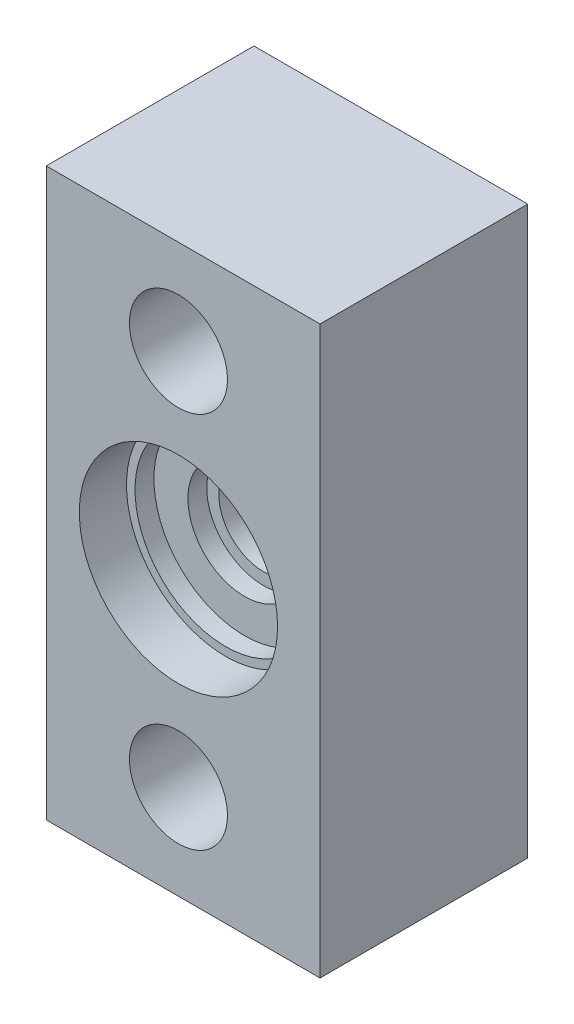
ISO-10303-21;
HEADER;
FILE_DESCRIPTION(('STEP AP214'),'2;1');
FILE_NAME('part.step','',(''),(''),'','','');
FILE_SCHEMA(('AUTOMOTIVE_DESIGN { 1 0 10303 214 1 1 1 1 }'));
ENDSEC;
DATA;
#1=APPLICATION_CONTEXT('core data for automotive mechanical design processes');
#2=APPLICATION_PROTOCOL_DEFINITION('international standard','automotive_design',2000,#1);
#3=PRODUCT_CONTEXT('',#1,'mechanical');
#4=PRODUCT('Part','Part','',(#3));
#5=PRODUCT_RELATED_PRODUCT_CATEGORY('part','',(#4));
#6=PRODUCT_DEFINITION_FORMATION('','',#4);
#7=PRODUCT_DEFINITION_CONTEXT('part definition',#1,'design');
#8=PRODUCT_DEFINITION('design','',#6,#7);
#9=PRODUCT_DEFINITION_SHAPE('','',#8);
#10=(LENGTH_UNIT() NAMED_UNIT(*) SI_UNIT(.MILLI.,.METRE.));
#11=(NAMED_UNIT(*) PLANE_ANGLE_UNIT() SI_UNIT($,.RADIAN.));
#12=(NAMED_UNIT(*) SI_UNIT($,.STERADIAN.) SOLID_ANGLE_UNIT());
#13=UNCERTAINTY_MEASURE_WITH_UNIT(LENGTH_MEASURE(1.E-05),#10,'distance_accuracy_value','');
#14=(GEOMETRIC_REPRESENTATION_CONTEXT(3) GLOBAL_UNCERTAINTY_ASSIGNED_CONTEXT((#13)) GLOBAL_UNIT_ASSIGNED_CONTEXT((#10,
#11,#12)) REPRESENTATION_CONTEXT('',''));
#15=CARTESIAN_POINT('',(0.,0.,0.));
#16=DIRECTION('',(0.,0.,1.));
#17=DIRECTION('',(1.,0.,0.));
#18=AXIS2_PLACEMENT_3D('',#15,#16,#17);
#19=CARTESIAN_POINT('',(0.,0.,6.));
#20=DIRECTION('',(0.,0.,-1.));
#21=DIRECTION('',(-1.,0.,0.));
#22=AXIS2_PLACEMENT_3D('',#19,#20,#21);
#23=CYLINDRICAL_SURFACE('',#22,2.36);
#24=CARTESIAN_POINT('',(0.,0.,0.));
#25=DIRECTION('',(0.,0.,-1.));
#26=DIRECTION('',(-1.,0.,0.));
#27=AXIS2_PLACEMENT_3D('',#24,#25,#26);
#28=CIRCLE('',#27,2.36);
#29=CARTESIAN_POINT('',(-2.36,0.,0.));
#30=VERTEX_POINT('',#29);
#31=EDGE_CURVE('E104',#30,#30,#28,.F.);
#32=ORIENTED_EDGE('',*,*,#31,.F.);
#33=EDGE_LOOP('',(#32));
#34=FACE_BOUND('',#33,.T.);
#35=CARTESIAN_POINT('',(0.,0.,1.5));
#36=DIRECTION('',(0.,0.,1.));
#37=DIRECTION('',(1.,0.,0.));
#38=AXIS2_PLACEMENT_3D('',#35,#36,#37);
#39=CIRCLE('',#38,2.36);
#40=CARTESIAN_POINT('',(2.36,0.,1.5));
#41=VERTEX_POINT('',#40);
#42=EDGE_CURVE('E48',#41,#41,#39,.T.);
#43=ORIENTED_EDGE('',*,*,#42,.T.);
#44=EDGE_LOOP('',(#43));
#45=FACE_BOUND('',#44,.T.);
#46=ADVANCED_FACE('F44',(#34,#45),#23,.F.);
#47=CARTESIAN_POINT('',(7.5,-15.,6.));
#48=DIRECTION('',(0.,1.,0.));
#49=DIRECTION('',(-1.,0.,0.));
#50=AXIS2_PLACEMENT_3D('',#47,#48,#49);
#51=PLANE('',#50);
#52=DIRECTION('',(1.,0.,0.));
#53=VECTOR('',#52,1.);
#54=CARTESIAN_POINT('',(7.5,-15.,6.));
#55=LINE('',#54,#53);
#56=CARTESIAN_POINT('',(-7.,-15.,6.));
#57=VERTEX_POINT('',#56);
#58=CARTESIAN_POINT('',(7.5,-15.,6.));
#59=VERTEX_POINT('',#58);
#60=EDGE_CURVE('E127',#57,#59,#55,.T.);
#61=ORIENTED_EDGE('',*,*,#60,.F.);
#62=DIRECTION('',(0.,0.,-1.));
#63=VECTOR('',#62,1.);
#64=CARTESIAN_POINT('',(-7.,-15.,42.5918125935021));
#65=LINE('',#64,#63);
#66=CARTESIAN_POINT('',(-7.,-15.,-5.));
#67=VERTEX_POINT('',#66);
#68=EDGE_CURVE('E89',#57,#67,#65,.T.);
#69=ORIENTED_EDGE('',*,*,#68,.T.);
#70=DIRECTION('',(-1.,0.,0.));
#71=VECTOR('',#70,1.);
#72=CARTESIAN_POINT('',(-7.,-15.,-5.));
#73=LINE('',#72,#71);
#74=CARTESIAN_POINT('',(7.5,-15.,-5.));
#75=VERTEX_POINT('',#74);
#76=EDGE_CURVE('E90',#75,#67,#73,.T.);
#77=ORIENTED_EDGE('',*,*,#76,.F.);
#78=DIRECTION('',(0.,0.,-1.));
#79=VECTOR('',#78,1.);
#80=CARTESIAN_POINT('',(7.5,-15.,6.));
#81=LINE('',#80,#79);
#82=EDGE_CURVE('E11',#59,#75,#81,.T.);
#83=ORIENTED_EDGE('',*,*,#82,.F.);
#84=EDGE_LOOP('',(#61,#69,#77,#83));
#85=FACE_BOUND('',#84,.T.);
#86=ADVANCED_FACE('F46',(#85),#51,.F.);
#87=CARTESIAN_POINT('',(7.5,15.,6.));
#88=DIRECTION('',(-1.,0.,0.));
#89=DIRECTION('',(0.,-1.,0.));
#90=AXIS2_PLACEMENT_3D('',#87,#88,#89);
#91=PLANE('',#90);
#92=ORIENTED_EDGE('',*,*,#82,.T.);
#93=DIRECTION('',(0.,-1.,0.));
#94=VECTOR('',#93,1.);
#95=CARTESIAN_POINT('',(7.50000000000001,15.,-5.));
#96=LINE('',#95,#94);
#97=CARTESIAN_POINT('',(7.50000000000001,15.,-5.));
#98=VERTEX_POINT('',#97);
#99=EDGE_CURVE('E99',#98,#75,#96,.T.);
#100=ORIENTED_EDGE('',*,*,#99,.F.);
#101=DIRECTION('',(0.,0.,-1.));
#102=VECTOR('',#101,1.);
#103=CARTESIAN_POINT('',(7.5,15.,6.));
#104=LINE('',#103,#102);
#105=CARTESIAN_POINT('',(7.5,15.,6.));
#106=VERTEX_POINT('',#105);
#107=EDGE_CURVE('E53',#106,#98,#104,.T.);
#108=ORIENTED_EDGE('',*,*,#107,.F.);
#109=DIRECTION('',(0.,1.,0.));
#110=VECTOR('',#109,1.);
#111=CARTESIAN_POINT('',(7.5,15.,6.));
#112=LINE('',#111,#110);
#113=EDGE_CURVE('E131',#59,#106,#112,.T.);
#114=ORIENTED_EDGE('',*,*,#113,.F.);
#115=EDGE_LOOP('',(#92,#100,#108,#114));
#116=FACE_BOUND('',#115,.T.);
#117=ADVANCED_FACE('F139',(#116),#91,.F.);
#118=CARTESIAN_POINT('',(7.5,15.,6.));
#119=DIRECTION('',(0.,-1.,0.));
#120=DIRECTION('',(1.,0.,0.));
#121=AXIS2_PLACEMENT_3D('',#118,#119,#120);
#122=PLANE('',#121);
#123=ORIENTED_EDGE('',*,*,#107,.T.);
#124=DIRECTION('',(1.,0.,0.));
#125=VECTOR('',#124,1.);
#126=CARTESIAN_POINT('',(-7.,15.,-5.));
#127=LINE('',#126,#125);
#128=CARTESIAN_POINT('',(-7.,15.,-5.));
#129=VERTEX_POINT('',#128);
#130=EDGE_CURVE('E93',#129,#98,#127,.T.);
#131=ORIENTED_EDGE('',*,*,#130,.F.);
#132=DIRECTION('',(0.,0.,-1.));
#133=VECTOR('',#132,1.);
#134=CARTESIAN_POINT('',(-7.00000000000001,15.,42.5918125935021));
#135=LINE('',#134,#133);
#136=CARTESIAN_POINT('',(-7.,15.,6.));
#137=VERTEX_POINT('',#136);
#138=EDGE_CURVE('E60',#137,#129,#135,.T.);
#139=ORIENTED_EDGE('',*,*,#138,.F.);
#140=DIRECTION('',(-1.,0.,0.));
#141=VECTOR('',#140,1.);
#142=CARTESIAN_POINT('',(7.5,15.,6.));
#143=LINE('',#142,#141);
#144=EDGE_CURVE('E133',#106,#137,#143,.T.);
#145=ORIENTED_EDGE('',*,*,#144,.F.);
#146=EDGE_LOOP('',(#123,#131,#139,#145));
#147=FACE_BOUND('',#146,.T.);
#148=ADVANCED_FACE('F94',(#147),#122,.F.);
#149=CARTESIAN_POINT('',(0.,0.,6.));
#150=DIRECTION('',(0.,0.,-1.));
#151=DIRECTION('',(-1.,0.,0.));
#152=AXIS2_PLACEMENT_3D('',#149,#150,#151);
#153=PLANE('',#152);
#154=CARTESIAN_POINT('',(0.,-10.,6.));
#155=DIRECTION('',(0.,0.,-1.));
#156=DIRECTION('',(-1.,0.,0.));
#157=AXIS2_PLACEMENT_3D('',#154,#155,#156);
#158=CIRCLE('',#157,2.595);
#159=CARTESIAN_POINT('',(-2.595,-10.,6.));
#160=VERTEX_POINT('',#159);
#161=EDGE_CURVE('E352',#160,#160,#158,.T.);
#162=ORIENTED_EDGE('',*,*,#161,.T.);
#163=EDGE_LOOP('',(#162));
#164=FACE_BOUND('',#163,.T.);
#165=CARTESIAN_POINT('',(0.,9.99999999999999,6.));
#166=DIRECTION('',(0.,0.,-1.));
#167=DIRECTION('',(-1.,0.,0.));
#168=AXIS2_PLACEMENT_3D('',#165,#166,#167);
#169=CIRCLE('',#168,2.595);
#170=CARTESIAN_POINT('',(-2.595,9.99999999999999,6.));
#171=VERTEX_POINT('',#170);
#172=EDGE_CURVE('E338',#171,#171,#169,.T.);
#173=ORIENTED_EDGE('',*,*,#172,.T.);
#174=EDGE_LOOP('',(#173));
#175=FACE_BOUND('',#174,.T.);
#176=CARTESIAN_POINT('',(0.,0.,6.));
#177=DIRECTION('',(0.,0.,1.));
#178=DIRECTION('',(1.,0.,0.));
#179=AXIS2_PLACEMENT_3D('',#176,#177,#178);
#180=CIRCLE('',#179,5.25);
#181=CARTESIAN_POINT('',(5.25,0.,6.));
#182=VERTEX_POINT('',#181);
#183=EDGE_CURVE('E121',#182,#182,#180,.T.);
#184=ORIENTED_EDGE('',*,*,#183,.F.);
#185=EDGE_LOOP('',(#184));
#186=FACE_BOUND('',#185,.T.);
#187=ORIENTED_EDGE('',*,*,#144,.T.);
#188=DIRECTION('',(0.,-1.,0.));
#189=VECTOR('',#188,1.);
#190=CARTESIAN_POINT('',(-7.,0.,6.));
#191=LINE('',#190,#189);
#192=EDGE_CURVE('E67',#137,#57,#191,.T.);
#193=ORIENTED_EDGE('',*,*,#192,.T.);
#194=ORIENTED_EDGE('',*,*,#60,.T.);
#195=ORIENTED_EDGE('',*,*,#113,.T.);
#196=EDGE_LOOP('',(#187,#193,#194,#195));
#197=FACE_BOUND('',#196,.T.);
#198=ADVANCED_FACE('F135',(#164,#175,#186,#197),#153,.F.);
#199=CARTESIAN_POINT('',(0.,0.,3.5));
#200=DIRECTION('',(0.,0.,1.));
#201=DIRECTION('',(1.,0.,0.));
#202=AXIS2_PLACEMENT_3D('',#199,#200,#201);
#203=CYLINDRICAL_SURFACE('',#202,5.25);
#204=CARTESIAN_POINT('',(0.,0.,3.5));
#205=DIRECTION('',(0.,0.,1.));
#206=DIRECTION('',(1.,0.,0.));
#207=AXIS2_PLACEMENT_3D('',#204,#205,#206);
#208=CIRCLE('',#207,5.25);
#209=CARTESIAN_POINT('',(5.25,0.,3.5));
#210=VERTEX_POINT('',#209);
#211=EDGE_CURVE('E124',#210,#210,#208,.T.);
#212=ORIENTED_EDGE('',*,*,#211,.F.);
#213=EDGE_LOOP('',(#212));
#214=FACE_BOUND('',#213,.T.);
#215=ORIENTED_EDGE('',*,*,#183,.T.);
#216=EDGE_LOOP('',(#215));
#217=FACE_BOUND('',#216,.T.);
#218=ADVANCED_FACE('F165',(#214,#217),#203,.F.);
#219=CARTESIAN_POINT('',(0.,0.,3.5));
#220=DIRECTION('',(0.,0.,1.));
#221=DIRECTION('',(1.,0.,0.));
#222=AXIS2_PLACEMENT_3D('',#219,#220,#221);
#223=PLANE('',#222);
#224=CARTESIAN_POINT('',(0.,0.,3.5));
#225=DIRECTION('',(0.,0.,1.));
#226=DIRECTION('',(1.,0.,0.));
#227=AXIS2_PLACEMENT_3D('',#224,#225,#226);
#228=CIRCLE('',#227,4.8);
#229=CARTESIAN_POINT('',(4.8,0.,3.5));
#230=VERTEX_POINT('',#229);
#231=EDGE_CURVE('E116',#230,#230,#228,.T.);
#232=ORIENTED_EDGE('',*,*,#231,.F.);
#233=EDGE_LOOP('',(#232));
#234=FACE_BOUND('',#233,.T.);
#235=ORIENTED_EDGE('',*,*,#211,.T.);
#236=EDGE_LOOP('',(#235));
#237=FACE_BOUND('',#236,.T.);
#238=ADVANCED_FACE('F161',(#234,#237),#223,.T.);
#239=CARTESIAN_POINT('',(0.,0.,2.5));
#240=DIRECTION('',(0.,0.,1.));
#241=DIRECTION('',(1.,0.,0.));
#242=AXIS2_PLACEMENT_3D('',#239,#240,#241);
#243=CYLINDRICAL_SURFACE('',#242,4.8);
#244=CARTESIAN_POINT('',(0.,0.,2.5));
#245=DIRECTION('',(0.,0.,1.));
#246=DIRECTION('',(1.,0.,0.));
#247=AXIS2_PLACEMENT_3D('',#244,#245,#246);
#248=CIRCLE('',#247,4.8);
#249=CARTESIAN_POINT('',(4.8,0.,2.5));
#250=VERTEX_POINT('',#249);
#251=EDGE_CURVE('E118',#250,#250,#248,.T.);
#252=ORIENTED_EDGE('',*,*,#251,.F.);
#253=EDGE_LOOP('',(#252));
#254=FACE_BOUND('',#253,.T.);
#255=ORIENTED_EDGE('',*,*,#231,.T.);
#256=EDGE_LOOP('',(#255));
#257=FACE_BOUND('',#256,.T.);
#258=ADVANCED_FACE('F157',(#254,#257),#243,.F.);
#259=CARTESIAN_POINT('',(0.,0.,2.5));
#260=DIRECTION('',(0.,0.,1.));
#261=DIRECTION('',(1.,0.,0.));
#262=AXIS2_PLACEMENT_3D('',#259,#260,#261);
#263=PLANE('',#262);
#264=CARTESIAN_POINT('',(0.,0.,2.5));
#265=DIRECTION('',(0.,0.,1.));
#266=DIRECTION('',(1.,0.,0.));
#267=AXIS2_PLACEMENT_3D('',#264,#265,#266);
#268=CIRCLE('',#267,3.);
#269=CARTESIAN_POINT('',(3.,0.,2.5));
#270=VERTEX_POINT('',#269);
#271=EDGE_CURVE('E361',#270,#270,#268,.T.);
#272=ORIENTED_EDGE('',*,*,#271,.F.);
#273=EDGE_LOOP('',(#272));
#274=FACE_BOUND('',#273,.T.);
#275=ORIENTED_EDGE('',*,*,#251,.T.);
#276=EDGE_LOOP('',(#275));
#277=FACE_BOUND('',#276,.T.);
#278=ADVANCED_FACE('F154',(#274,#277),#263,.T.);
#279=CARTESIAN_POINT('',(-7.00000000000001,15.,42.5918125935021));
#280=DIRECTION('',(1.,0.,0.));
#281=DIRECTION('',(0.,1.,0.));
#282=AXIS2_PLACEMENT_3D('',#279,#280,#281);
#283=PLANE('',#282);
#284=ORIENTED_EDGE('',*,*,#192,.F.);
#285=ORIENTED_EDGE('',*,*,#138,.T.);
#286=DIRECTION('',(0.,1.,0.));
#287=VECTOR('',#286,1.);
#288=CARTESIAN_POINT('',(-7.,15.,-5.));
#289=LINE('',#288,#287);
#290=EDGE_CURVE('E88',#67,#129,#289,.T.);
#291=ORIENTED_EDGE('',*,*,#290,.F.);
#292=ORIENTED_EDGE('',*,*,#68,.F.);
#293=EDGE_LOOP('',(#284,#285,#291,#292));
#294=FACE_BOUND('',#293,.T.);
#295=ADVANCED_FACE('F85',(#294),#283,.F.);
#296=CARTESIAN_POINT('',(0.,0.,-5.));
#297=DIRECTION('',(0.,0.,1.));
#298=DIRECTION('',(1.,0.,0.));
#299=AXIS2_PLACEMENT_3D('',#296,#297,#298);
#300=PLANE('',#299);
#301=CARTESIAN_POINT('',(0.,-10.,-5.));
#302=DIRECTION('',(0.,0.,-1.));
#303=DIRECTION('',(-1.,0.,0.));
#304=AXIS2_PLACEMENT_3D('',#301,#302,#303);
#305=CIRCLE('',#304,2.595);
#306=CARTESIAN_POINT('',(-2.595,-10.,-5.));
#307=VERTEX_POINT('',#306);
#308=EDGE_CURVE('E344',#307,#307,#305,.T.);
#309=ORIENTED_EDGE('',*,*,#308,.F.);
#310=EDGE_LOOP('',(#309));
#311=FACE_BOUND('',#310,.T.);
#312=CARTESIAN_POINT('',(0.,9.99999999999999,-5.));
#313=DIRECTION('',(0.,0.,-1.));
#314=DIRECTION('',(-1.,0.,0.));
#315=AXIS2_PLACEMENT_3D('',#312,#313,#314);
#316=CIRCLE('',#315,2.595);
#317=CARTESIAN_POINT('',(-2.595,9.99999999999999,-5.));
#318=VERTEX_POINT('',#317);
#319=EDGE_CURVE('E341',#318,#318,#316,.T.);
#320=ORIENTED_EDGE('',*,*,#319,.F.);
#321=EDGE_LOOP('',(#320));
#322=FACE_BOUND('',#321,.T.);
#323=CARTESIAN_POINT('',(0.,0.,-5.));
#324=DIRECTION('',(0.,0.,-1.));
#325=DIRECTION('',(-1.,0.,0.));
#326=AXIS2_PLACEMENT_3D('',#323,#324,#325);
#327=CIRCLE('',#326,4.);
#328=CARTESIAN_POINT('',(-4.,0.,-5.));
#329=VERTEX_POINT('',#328);
#330=EDGE_CURVE('E110',#329,#329,#327,.T.);
#331=ORIENTED_EDGE('',*,*,#330,.F.);
#332=EDGE_LOOP('',(#331));
#333=FACE_BOUND('',#332,.T.);
#334=ORIENTED_EDGE('',*,*,#290,.T.);
#335=ORIENTED_EDGE('',*,*,#130,.T.);
#336=ORIENTED_EDGE('',*,*,#99,.T.);
#337=ORIENTED_EDGE('',*,*,#76,.T.);
#338=EDGE_LOOP('',(#334,#335,#336,#337));
#339=FACE_BOUND('',#338,.T.);
#340=ADVANCED_FACE('F102',(#311,#322,#333,#339),#300,.F.);
#341=CARTESIAN_POINT('',(0.,0.,0.));
#342=DIRECTION('',(0.,0.,-1.));
#343=DIRECTION('',(-1.,0.,0.));
#344=AXIS2_PLACEMENT_3D('',#341,#342,#343);
#345=PLANE('',#344);
#346=CARTESIAN_POINT('',(0.,0.,0.));
#347=DIRECTION('',(0.,0.,-1.));
#348=DIRECTION('',(-1.,0.,0.));
#349=AXIS2_PLACEMENT_3D('',#346,#347,#348);
#350=CIRCLE('',#349,4.);
#351=CARTESIAN_POINT('',(-4.,0.,0.));
#352=VERTEX_POINT('',#351);
#353=EDGE_CURVE('E107',#352,#352,#350,.T.);
#354=ORIENTED_EDGE('',*,*,#353,.T.);
#355=EDGE_LOOP('',(#354));
#356=FACE_BOUND('',#355,.T.);
#357=ORIENTED_EDGE('',*,*,#31,.T.);
#358=EDGE_LOOP('',(#357));
#359=FACE_BOUND('',#358,.T.);
#360=ADVANCED_FACE('F200',(#356,#359),#345,.T.);
#361=CARTESIAN_POINT('',(0.,0.,0.));
#362=DIRECTION('',(0.,0.,-1.));
#363=DIRECTION('',(-1.,0.,0.));
#364=AXIS2_PLACEMENT_3D('',#361,#362,#363);
#365=CYLINDRICAL_SURFACE('',#364,4.);
#366=ORIENTED_EDGE('',*,*,#353,.F.);
#367=EDGE_LOOP('',(#366));
#368=FACE_BOUND('',#367,.T.);
#369=ORIENTED_EDGE('',*,*,#330,.T.);
#370=EDGE_LOOP('',(#369));
#371=FACE_BOUND('',#370,.T.);
#372=ADVANCED_FACE('F206',(#368,#371),#365,.F.);
#373=CARTESIAN_POINT('',(0.,9.99999999999999,6.));
#374=DIRECTION('',(0.,0.,-1.));
#375=DIRECTION('',(-1.,0.,0.));
#376=AXIS2_PLACEMENT_3D('',#373,#374,#375);
#377=CYLINDRICAL_SURFACE('',#376,2.595);
#378=ORIENTED_EDGE('',*,*,#172,.F.);
#379=EDGE_LOOP('',(#378));
#380=FACE_BOUND('',#379,.T.);
#381=ORIENTED_EDGE('',*,*,#319,.T.);
#382=EDGE_LOOP('',(#381));
#383=FACE_BOUND('',#382,.T.);
#384=ADVANCED_FACE('F213',(#380,#383),#377,.F.);
#385=CARTESIAN_POINT('',(0.,-10.,6.));
#386=DIRECTION('',(0.,0.,-1.));
#387=DIRECTION('',(-1.,0.,0.));
#388=AXIS2_PLACEMENT_3D('',#385,#386,#387);
#389=CYLINDRICAL_SURFACE('',#388,2.595);
#390=ORIENTED_EDGE('',*,*,#161,.F.);
#391=EDGE_LOOP('',(#390));
#392=FACE_BOUND('',#391,.T.);
#393=ORIENTED_EDGE('',*,*,#308,.T.);
#394=EDGE_LOOP('',(#393));
#395=FACE_BOUND('',#394,.T.);
#396=ADVANCED_FACE('F223',(#392,#395),#389,.F.);
#397=CARTESIAN_POINT('',(0.,0.,1.5));
#398=DIRECTION('',(0.,0.,1.));
#399=DIRECTION('',(1.,0.,0.));
#400=AXIS2_PLACEMENT_3D('',#397,#398,#399);
#401=CYLINDRICAL_SURFACE('',#400,3.);
#402=CARTESIAN_POINT('',(0.,0.,1.5));
#403=DIRECTION('',(0.,0.,1.));
#404=DIRECTION('',(1.,0.,0.));
#405=AXIS2_PLACEMENT_3D('',#402,#403,#404);
#406=CIRCLE('',#405,3.);
#407=CARTESIAN_POINT('',(3.,0.,1.5));
#408=VERTEX_POINT('',#407);
#409=EDGE_CURVE('E347',#408,#408,#406,.T.);
#410=ORIENTED_EDGE('',*,*,#409,.F.);
#411=EDGE_LOOP('',(#410));
#412=FACE_BOUND('',#411,.T.);
#413=ORIENTED_EDGE('',*,*,#271,.T.);
#414=EDGE_LOOP('',(#413));
#415=FACE_BOUND('',#414,.T.);
#416=ADVANCED_FACE('F219',(#412,#415),#401,.F.);
#417=CARTESIAN_POINT('',(0.,0.,1.5));
#418=DIRECTION('',(0.,0.,1.));
#419=DIRECTION('',(1.,0.,0.));
#420=AXIS2_PLACEMENT_3D('',#417,#418,#419);
#421=PLANE('',#420);
#422=ORIENTED_EDGE('',*,*,#42,.F.);
#423=EDGE_LOOP('',(#422));
#424=FACE_BOUND('',#423,.T.);
#425=ORIENTED_EDGE('',*,*,#409,.T.);
#426=EDGE_LOOP('',(#425));
#427=FACE_BOUND('',#426,.T.);
#428=ADVANCED_FACE('F222',(#424,#427),#421,.T.);
#429=CLOSED_SHELL('',(#46,#86,#117,#148,#198,#218,#238,#258,#278,#295,#340,#360,#372,#384,#396,
#416,#428));
#430=MANIFOLD_SOLID_BREP('B2',#429);
#431=ADVANCED_BREP_SHAPE_REPRESENTATION('',(#18,#430),#14);
#432=SHAPE_DEFINITION_REPRESENTATION(#9,#431);
ENDSEC;
END-ISO-10303-21;
